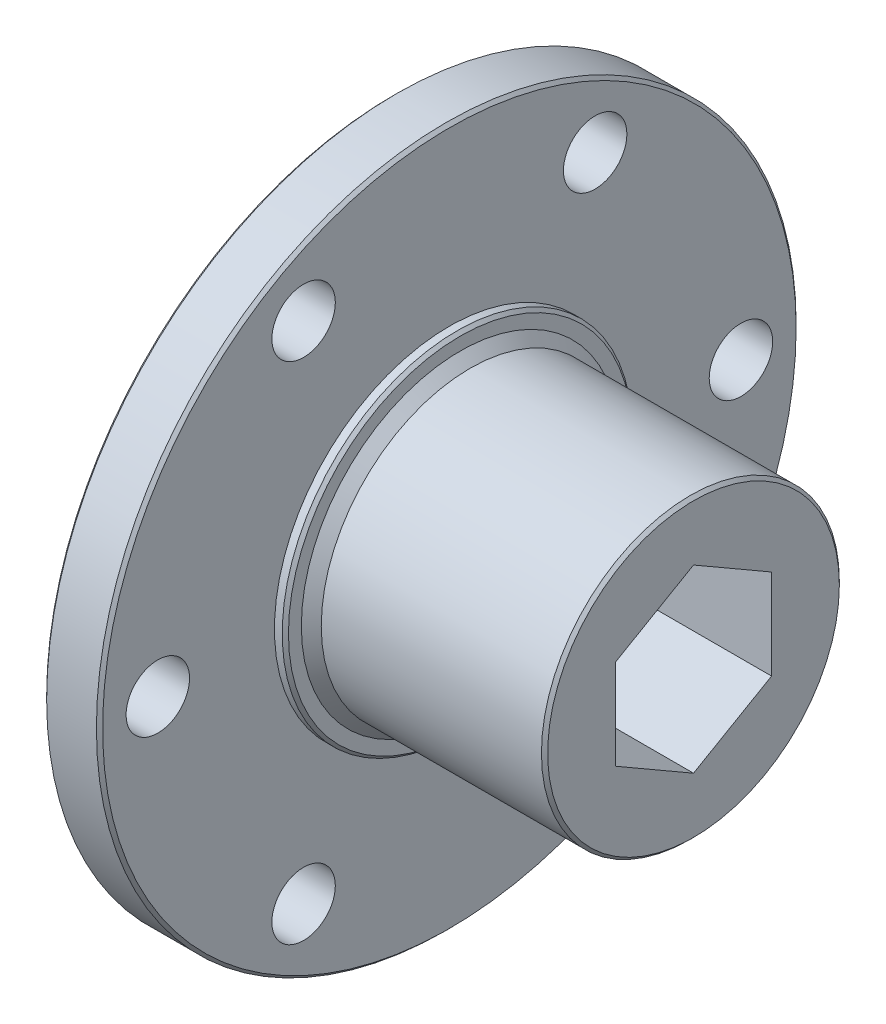
ISO-10303-21;
HEADER;
FILE_DESCRIPTION(('STEP AP214'),'2;1');
FILE_NAME('part.step','',(''),(''),'','','');
FILE_SCHEMA(('AUTOMOTIVE_DESIGN { 1 0 10303 214 1 1 1 1 }'));
ENDSEC;
DATA;
#1=APPLICATION_CONTEXT('core data for automotive mechanical design processes');
#2=APPLICATION_PROTOCOL_DEFINITION('international standard','automotive_design',2000,#1);
#3=PRODUCT_CONTEXT('',#1,'mechanical');
#4=PRODUCT('Part','Part','',(#3));
#5=PRODUCT_RELATED_PRODUCT_CATEGORY('part','',(#4));
#6=PRODUCT_DEFINITION_FORMATION('','',#4);
#7=PRODUCT_DEFINITION_CONTEXT('part definition',#1,'design');
#8=PRODUCT_DEFINITION('design','',#6,#7);
#9=PRODUCT_DEFINITION_SHAPE('','',#8);
#10=(LENGTH_UNIT() NAMED_UNIT(*) SI_UNIT(.MILLI.,.METRE.));
#11=(NAMED_UNIT(*) PLANE_ANGLE_UNIT() SI_UNIT($,.RADIAN.));
#12=(NAMED_UNIT(*) SI_UNIT($,.STERADIAN.) SOLID_ANGLE_UNIT());
#13=UNCERTAINTY_MEASURE_WITH_UNIT(LENGTH_MEASURE(1.E-05),#10,'distance_accuracy_value','');
#14=(GEOMETRIC_REPRESENTATION_CONTEXT(3) GLOBAL_UNCERTAINTY_ASSIGNED_CONTEXT((#13)) GLOBAL_UNIT_ASSIGNED_CONTEXT((#10,
#11,#12)) REPRESENTATION_CONTEXT('',''));
#15=CARTESIAN_POINT('',(0.,0.,0.));
#16=DIRECTION('',(0.,0.,1.));
#17=DIRECTION('',(1.,0.,0.));
#18=AXIS2_PLACEMENT_3D('',#15,#16,#17);
#19=CARTESIAN_POINT('',(-13.9240662460568,0.,0.));
#20=DIRECTION('',(-1.,0.,0.));
#21=DIRECTION('',(0.,0.,1.));
#22=AXIS2_PLACEMENT_3D('',#19,#20,#21);
#23=CYLINDRICAL_SURFACE('',#22,28.575);
#24=CARTESIAN_POINT('',(-18.2420662460566,0.,0.));
#25=DIRECTION('',(-1.,0.,0.));
#26=DIRECTION('',(0.,0.,1.));
#27=AXIS2_PLACEMENT_3D('',#24,#25,#26);
#28=CIRCLE('',#27,28.575);
#29=CARTESIAN_POINT('',(-18.2420662460566,0.,28.575));
#30=VERTEX_POINT('',#29);
#31=EDGE_CURVE('E174',#30,#30,#28,.F.);
#32=ORIENTED_EDGE('',*,*,#31,.T.);
#33=EDGE_LOOP('',(#32));
#34=FACE_BOUND('',#33,.T.);
#35=CARTESIAN_POINT('',(-14.1780662460569,0.,0.));
#36=DIRECTION('',(1.,0.,0.));
#37=DIRECTION('',(0.,0.,-1.));
#38=AXIS2_PLACEMENT_3D('',#35,#36,#37);
#39=CIRCLE('',#38,28.575);
#40=CARTESIAN_POINT('',(-14.1780662460569,0.,-28.575));
#41=VERTEX_POINT('',#40);
#42=EDGE_CURVE('E171',#41,#41,#39,.F.);
#43=ORIENTED_EDGE('',*,*,#42,.T.);
#44=EDGE_LOOP('',(#43));
#45=FACE_BOUND('',#44,.T.);
#46=ADVANCED_FACE('F32',(#34,#45),#23,.T.);
#47=CARTESIAN_POINT('',(-13.9240662460568,28.575,0.));
#48=DIRECTION('',(1.,0.,0.));
#49=DIRECTION('',(0.,0.,-1.));
#50=AXIS2_PLACEMENT_3D('',#47,#48,#49);
#51=PLANE('',#50);
#52=CARTESIAN_POINT('',(-13.9240662460568,0.,0.));
#53=DIRECTION('',(1.,0.,0.));
#54=DIRECTION('',(0.,0.,-1.));
#55=AXIS2_PLACEMENT_3D('',#52,#53,#54);
#56=CIRCLE('',#55,28.3209999999999);
#57=CARTESIAN_POINT('',(-13.9240662460568,0.,-28.3209999999999));
#58=VERTEX_POINT('',#57);
#59=EDGE_CURVE('E11',#58,#58,#56,.T.);
#60=ORIENTED_EDGE('',*,*,#59,.T.);
#61=EDGE_LOOP('',(#60));
#62=FACE_BOUND('',#61,.T.);
#63=CARTESIAN_POINT('',(-13.9240662460568,20.6222299276169,11.90625));
#64=DIRECTION('',(1.,0.,0.));
#65=DIRECTION('',(0.,0.,-1.));
#66=AXIS2_PLACEMENT_3D('',#63,#64,#65);
#67=CIRCLE('',#66,2.5908);
#68=CARTESIAN_POINT('',(-13.9240662460568,20.6222299276169,9.31545000000001));
#69=VERTEX_POINT('',#68);
#70=EDGE_CURVE('E152',#69,#69,#67,.T.);
#71=ORIENTED_EDGE('',*,*,#70,.F.);
#72=EDGE_LOOP('',(#71));
#73=FACE_BOUND('',#72,.T.);
#74=CARTESIAN_POINT('',(-13.9240662460568,0.,-23.8125));
#75=DIRECTION('',(1.,0.,0.));
#76=DIRECTION('',(0.,0.,-1.));
#77=AXIS2_PLACEMENT_3D('',#74,#75,#76);
#78=CIRCLE('',#77,2.5908);
#79=CARTESIAN_POINT('',(-13.9240662460568,0.,-26.4033));
#80=VERTEX_POINT('',#79);
#81=EDGE_CURVE('E326',#80,#80,#78,.T.);
#82=ORIENTED_EDGE('',*,*,#81,.F.);
#83=EDGE_LOOP('',(#82));
#84=FACE_BOUND('',#83,.T.);
#85=CARTESIAN_POINT('',(-13.9240662460568,-20.622229927617,11.9062499999999));
#86=DIRECTION('',(1.,0.,0.));
#87=DIRECTION('',(0.,0.,-1.));
#88=AXIS2_PLACEMENT_3D('',#85,#86,#87);
#89=CIRCLE('',#88,2.5908);
#90=CARTESIAN_POINT('',(-13.9240662460568,-20.622229927617,9.31544999999995));
#91=VERTEX_POINT('',#90);
#92=EDGE_CURVE('E330',#91,#91,#89,.T.);
#93=ORIENTED_EDGE('',*,*,#92,.F.);
#94=EDGE_LOOP('',(#93));
#95=FACE_BOUND('',#94,.T.);
#96=CARTESIAN_POINT('',(-13.9240662460568,-20.6222299276169,-11.90625));
#97=DIRECTION('',(1.,0.,0.));
#98=DIRECTION('',(0.,0.,-1.));
#99=AXIS2_PLACEMENT_3D('',#96,#97,#98);
#100=CIRCLE('',#99,2.5908);
#101=CARTESIAN_POINT('',(-13.9240662460568,-20.6222299276169,-14.49705));
#102=VERTEX_POINT('',#101);
#103=EDGE_CURVE('E334',#102,#102,#100,.T.);
#104=ORIENTED_EDGE('',*,*,#103,.F.);
#105=EDGE_LOOP('',(#104));
#106=FACE_BOUND('',#105,.T.);
#107=CARTESIAN_POINT('',(-13.9240662460568,20.622229927617,-11.90625));
#108=DIRECTION('',(1.,0.,0.));
#109=DIRECTION('',(0.,0.,-1.));
#110=AXIS2_PLACEMENT_3D('',#107,#108,#109);
#111=CIRCLE('',#110,2.5908);
#112=CARTESIAN_POINT('',(-13.9240662460568,20.622229927617,-14.49705));
#113=VERTEX_POINT('',#112);
#114=EDGE_CURVE('E338',#113,#113,#111,.T.);
#115=ORIENTED_EDGE('',*,*,#114,.F.);
#116=EDGE_LOOP('',(#115));
#117=FACE_BOUND('',#116,.T.);
#118=CARTESIAN_POINT('',(-13.9240662460568,0.,23.8125));
#119=DIRECTION('',(1.,0.,0.));
#120=DIRECTION('',(0.,0.,-1.));
#121=AXIS2_PLACEMENT_3D('',#118,#119,#120);
#122=CIRCLE('',#121,2.5908);
#123=CARTESIAN_POINT('',(-13.9240662460568,0.,21.2217));
#124=VERTEX_POINT('',#123);
#125=EDGE_CURVE('E109',#124,#124,#122,.T.);
#126=ORIENTED_EDGE('',*,*,#125,.F.);
#127=EDGE_LOOP('',(#126));
#128=FACE_BOUND('',#127,.T.);
#129=CARTESIAN_POINT('',(-13.9240662460568,0.,0.));
#130=DIRECTION('',(1.,0.,0.));
#131=DIRECTION('',(0.,0.,-1.));
#132=AXIS2_PLACEMENT_3D('',#129,#130,#131);
#133=CIRCLE('',#132,14.2875);
#134=CARTESIAN_POINT('',(-13.9240662460568,0.,-14.2875));
#135=VERTEX_POINT('',#134);
#136=EDGE_CURVE('E147',#135,#135,#133,.T.);
#137=ORIENTED_EDGE('',*,*,#136,.F.);
#138=EDGE_LOOP('',(#137));
#139=FACE_BOUND('',#138,.T.);
#140=ADVANCED_FACE('F209',(#62,#73,#84,#95,#106,#117,#128,#139),#51,.T.);
#141=CARTESIAN_POINT('',(-18.4960662460568,0.,0.));
#142=DIRECTION('',(-1.,0.,0.));
#143=DIRECTION('',(0.,0.,1.));
#144=AXIS2_PLACEMENT_3D('',#141,#142,#143);
#145=PLANE('',#144);
#146=CARTESIAN_POINT('',(-18.4960662460568,0.,0.));
#147=DIRECTION('',(-1.,0.,0.));
#148=DIRECTION('',(0.,0.,1.));
#149=AXIS2_PLACEMENT_3D('',#146,#147,#148);
#150=CIRCLE('',#149,28.3209999999999);
#151=CARTESIAN_POINT('',(-18.4960662460568,0.,28.3209999999999));
#152=VERTEX_POINT('',#151);
#153=EDGE_CURVE('E168',#152,#152,#150,.T.);
#154=ORIENTED_EDGE('',*,*,#153,.T.);
#155=EDGE_LOOP('',(#154));
#156=FACE_BOUND('',#155,.T.);
#157=CARTESIAN_POINT('',(-18.4960662460568,20.6222299276169,11.90625));
#158=DIRECTION('',(-1.,0.,0.));
#159=DIRECTION('',(0.,0.,1.));
#160=AXIS2_PLACEMENT_3D('',#157,#158,#159);
#161=CIRCLE('',#160,2.5908);
#162=CARTESIAN_POINT('',(-18.4960662460568,20.6222299276169,14.49705));
#163=VERTEX_POINT('',#162);
#164=EDGE_CURVE('E156',#163,#163,#161,.T.);
#165=ORIENTED_EDGE('',*,*,#164,.F.);
#166=EDGE_LOOP('',(#165));
#167=FACE_BOUND('',#166,.T.);
#168=CARTESIAN_POINT('',(-18.4960662460568,0.,-23.8125));
#169=DIRECTION('',(-1.,0.,0.));
#170=DIRECTION('',(0.,0.,1.));
#171=AXIS2_PLACEMENT_3D('',#168,#169,#170);
#172=CIRCLE('',#171,2.5908);
#173=CARTESIAN_POINT('',(-18.4960662460568,0.,-21.2217));
#174=VERTEX_POINT('',#173);
#175=EDGE_CURVE('E155',#174,#174,#172,.T.);
#176=ORIENTED_EDGE('',*,*,#175,.F.);
#177=EDGE_LOOP('',(#176));
#178=FACE_BOUND('',#177,.T.);
#179=CARTESIAN_POINT('',(-18.4960662460568,-20.622229927617,11.9062499999999));
#180=DIRECTION('',(-1.,0.,0.));
#181=DIRECTION('',(0.,0.,1.));
#182=AXIS2_PLACEMENT_3D('',#179,#180,#181);
#183=CIRCLE('',#182,2.5908);
#184=CARTESIAN_POINT('',(-18.4960662460568,-20.622229927617,14.4970499999999));
#185=VERTEX_POINT('',#184);
#186=EDGE_CURVE('E249',#185,#185,#183,.T.);
#187=ORIENTED_EDGE('',*,*,#186,.F.);
#188=EDGE_LOOP('',(#187));
#189=FACE_BOUND('',#188,.T.);
#190=CARTESIAN_POINT('',(-18.4960662460568,-20.6222299276169,-11.90625));
#191=DIRECTION('',(-1.,0.,0.));
#192=DIRECTION('',(0.,0.,1.));
#193=AXIS2_PLACEMENT_3D('',#190,#191,#192);
#194=CIRCLE('',#193,2.5908);
#195=CARTESIAN_POINT('',(-18.4960662460568,-20.6222299276169,-9.31545000000004));
#196=VERTEX_POINT('',#195);
#197=EDGE_CURVE('E253',#196,#196,#194,.T.);
#198=ORIENTED_EDGE('',*,*,#197,.F.);
#199=EDGE_LOOP('',(#198));
#200=FACE_BOUND('',#199,.T.);
#201=CARTESIAN_POINT('',(-18.4960662460568,20.622229927617,-11.90625));
#202=DIRECTION('',(-1.,0.,0.));
#203=DIRECTION('',(0.,0.,1.));
#204=AXIS2_PLACEMENT_3D('',#201,#202,#203);
#205=CIRCLE('',#204,2.5908);
#206=CARTESIAN_POINT('',(-18.4960662460568,20.622229927617,-9.31544999999997));
#207=VERTEX_POINT('',#206);
#208=EDGE_CURVE('E257',#207,#207,#205,.T.);
#209=ORIENTED_EDGE('',*,*,#208,.F.);
#210=EDGE_LOOP('',(#209));
#211=FACE_BOUND('',#210,.T.);
#212=CARTESIAN_POINT('',(-18.4960662460568,0.,23.8125));
#213=DIRECTION('',(-1.,0.,0.));
#214=DIRECTION('',(0.,0.,1.));
#215=AXIS2_PLACEMENT_3D('',#212,#213,#214);
#216=CIRCLE('',#215,2.5908);
#217=CARTESIAN_POINT('',(-18.4960662460568,0.,26.4033));
#218=VERTEX_POINT('',#217);
#219=EDGE_CURVE('E261',#218,#218,#216,.T.);
#220=ORIENTED_EDGE('',*,*,#219,.F.);
#221=EDGE_LOOP('',(#220));
#222=FACE_BOUND('',#221,.T.);
#223=CARTESIAN_POINT('',(-18.4960662460568,0.,0.));
#224=DIRECTION('',(-1.,0.,0.));
#225=DIRECTION('',(0.,0.,1.));
#226=AXIS2_PLACEMENT_3D('',#223,#224,#225);
#227=CIRCLE('',#226,14.2875);
#228=CARTESIAN_POINT('',(-18.4960662460568,0.,14.2875));
#229=VERTEX_POINT('',#228);
#230=EDGE_CURVE('E140',#229,#229,#227,.T.);
#231=ORIENTED_EDGE('',*,*,#230,.F.);
#232=EDGE_LOOP('',(#231));
#233=FACE_BOUND('',#232,.T.);
#234=ADVANCED_FACE('F215',(#156,#167,#178,#189,#200,#211,#222,#233),#145,.T.);
#235=CARTESIAN_POINT('',(-13.0350662460568,0.,0.));
#236=DIRECTION('',(-1.,0.,0.));
#237=DIRECTION('',(0.,0.,1.));
#238=AXIS2_PLACEMENT_3D('',#235,#236,#237);
#239=CYLINDRICAL_SURFACE('',#238,14.2875);
#240=CARTESIAN_POINT('',(-13.2890662460569,0.,0.));
#241=DIRECTION('',(1.,0.,0.));
#242=DIRECTION('',(0.,0.,-1.));
#243=AXIS2_PLACEMENT_3D('',#240,#241,#242);
#244=CIRCLE('',#243,14.2875);
#245=CARTESIAN_POINT('',(-13.2890662460569,0.,-14.2875));
#246=VERTEX_POINT('',#245);
#247=EDGE_CURVE('E40',#246,#246,#244,.F.);
#248=ORIENTED_EDGE('',*,*,#247,.T.);
#249=EDGE_LOOP('',(#248));
#250=FACE_BOUND('',#249,.T.);
#251=ORIENTED_EDGE('',*,*,#136,.T.);
#252=EDGE_LOOP('',(#251));
#253=FACE_BOUND('',#252,.T.);
#254=ADVANCED_FACE('F182',(#250,#253),#239,.T.);
#255=CARTESIAN_POINT('',(-13.0350662460568,0.,0.));
#256=DIRECTION('',(1.,0.,0.));
#257=DIRECTION('',(0.,0.,-1.));
#258=AXIS2_PLACEMENT_3D('',#255,#256,#257);
#259=PLANE('',#258);
#260=CARTESIAN_POINT('',(-13.0350662460568,0.,0.));
#261=DIRECTION('',(1.,0.,0.));
#262=DIRECTION('',(0.,0.,-1.));
#263=AXIS2_PLACEMENT_3D('',#260,#261,#262);
#264=CIRCLE('',#263,14.0334999999999);
#265=CARTESIAN_POINT('',(-13.0350662460568,0.,-14.0334999999999));
#266=VERTEX_POINT('',#265);
#267=EDGE_CURVE('E177',#266,#266,#264,.T.);
#268=ORIENTED_EDGE('',*,*,#267,.T.);
#269=EDGE_LOOP('',(#268));
#270=FACE_BOUND('',#269,.T.);
#271=CARTESIAN_POINT('',(-13.0350662460568,0.,0.));
#272=DIRECTION('',(1.,0.,0.));
#273=DIRECTION('',(0.,0.,-1.));
#274=AXIS2_PLACEMENT_3D('',#271,#272,#273);
#275=CIRCLE('',#274,12.9794);
#276=CARTESIAN_POINT('',(-13.0350662460568,0.,-12.9794));
#277=VERTEX_POINT('',#276);
#278=EDGE_CURVE('E144',#277,#277,#275,.T.);
#279=ORIENTED_EDGE('',*,*,#278,.F.);
#280=EDGE_LOOP('',(#279));
#281=FACE_BOUND('',#280,.T.);
#282=ADVANCED_FACE('F191',(#270,#281),#259,.T.);
#283=CARTESIAN_POINT('',(-13.0350662460568,0.,0.));
#284=DIRECTION('',(-1.,0.,0.));
#285=DIRECTION('',(0.,0.,-1.));
#286=AXIS2_PLACEMENT_3D('',#283,#284,#285);
#287=CONICAL_SURFACE('',#286,12.9794,0.785398163397434);
#288=CARTESIAN_POINT('',(-12.2222662460567,0.,0.));
#289=DIRECTION('',(1.,0.,0.));
#290=DIRECTION('',(0.,0.,-1.));
#291=AXIS2_PLACEMENT_3D('',#288,#289,#290);
#292=CIRCLE('',#291,12.1666);
#293=CARTESIAN_POINT('',(-12.2222662460567,0.,-12.1666));
#294=VERTEX_POINT('',#293);
#295=EDGE_CURVE('E132',#294,#294,#292,.T.);
#296=ORIENTED_EDGE('',*,*,#295,.F.);
#297=EDGE_LOOP('',(#296));
#298=FACE_BOUND('',#297,.T.);
#299=ORIENTED_EDGE('',*,*,#278,.T.);
#300=EDGE_LOOP('',(#299));
#301=FACE_BOUND('',#300,.T.);
#302=ADVANCED_FACE('F194',(#298,#301),#287,.T.);
#303=CARTESIAN_POINT('',(6.01493375394323,0.,0.));
#304=DIRECTION('',(-1.,0.,0.));
#305=DIRECTION('',(0.,0.,1.));
#306=AXIS2_PLACEMENT_3D('',#303,#304,#305);
#307=CYLINDRICAL_SURFACE('',#306,12.1666);
#308=CARTESIAN_POINT('',(5.76093375394317,0.,0.));
#309=DIRECTION('',(1.,0.,0.));
#310=DIRECTION('',(0.,0.,-1.));
#311=AXIS2_PLACEMENT_3D('',#308,#309,#310);
#312=CIRCLE('',#311,12.1666);
#313=CARTESIAN_POINT('',(5.76093375394317,0.,-12.1666));
#314=VERTEX_POINT('',#313);
#315=EDGE_CURVE('E165',#314,#314,#312,.F.);
#316=ORIENTED_EDGE('',*,*,#315,.T.);
#317=EDGE_LOOP('',(#316));
#318=FACE_BOUND('',#317,.T.);
#319=ORIENTED_EDGE('',*,*,#295,.T.);
#320=EDGE_LOOP('',(#319));
#321=FACE_BOUND('',#320,.T.);
#322=ADVANCED_FACE('F199',(#318,#321),#307,.T.);
#323=CARTESIAN_POINT('',(6.01493375394323,0.,0.));
#324=DIRECTION('',(1.,0.,0.));
#325=DIRECTION('',(0.,0.,-1.));
#326=AXIS2_PLACEMENT_3D('',#323,#324,#325);
#327=PLANE('',#326);
#328=CARTESIAN_POINT('',(6.01493375394323,0.,0.));
#329=DIRECTION('',(1.,0.,0.));
#330=DIRECTION('',(0.,0.,-1.));
#331=AXIS2_PLACEMENT_3D('',#328,#329,#330);
#332=CIRCLE('',#331,11.9125999999999);
#333=CARTESIAN_POINT('',(6.01493375394323,0.,-11.9125999999999));
#334=VERTEX_POINT('',#333);
#335=EDGE_CURVE('E162',#334,#334,#332,.T.);
#336=ORIENTED_EDGE('',*,*,#335,.T.);
#337=EDGE_LOOP('',(#336));
#338=FACE_BOUND('',#337,.T.);
#339=DIRECTION('',(0.,0.500000000000001,-0.866025403784438));
#340=VECTOR('',#339,1.);
#341=CARTESIAN_POINT('',(6.01493375394323,3.68081890619155,6.3754));
#342=LINE('',#341,#340);
#343=CARTESIAN_POINT('',(6.01493375394323,3.68081890619155,6.3754));
#344=VERTEX_POINT('',#343);
#345=CARTESIAN_POINT('',(6.01493375394323,7.3616578123831,0.));
#346=VERTEX_POINT('',#345);
#347=EDGE_CURVE('E87',#344,#346,#342,.T.);
#348=ORIENTED_EDGE('',*,*,#347,.T.);
#349=DIRECTION('',(0.,-0.500000000000001,-0.866025403784438));
#350=VECTOR('',#349,1.);
#351=CARTESIAN_POINT('',(6.01493375394323,7.3616578123831,0.));
#352=LINE('',#351,#350);
#353=CARTESIAN_POINT('',(6.01493375394323,3.68081890619154,-6.37539999999999));
#354=VERTEX_POINT('',#353);
#355=EDGE_CURVE('E96',#346,#354,#352,.T.);
#356=ORIENTED_EDGE('',*,*,#355,.T.);
#357=DIRECTION('',(0.,-1.,0.));
#358=VECTOR('',#357,1.);
#359=CARTESIAN_POINT('',(6.01493375394323,3.68081890619155,-6.37539999999999));
#360=LINE('',#359,#358);
#361=CARTESIAN_POINT('',(6.01493375394323,-3.68085890619153,-6.37539999999999));
#362=VERTEX_POINT('',#361);
#363=EDGE_CURVE('E47',#354,#362,#360,.T.);
#364=ORIENTED_EDGE('',*,*,#363,.T.);
#365=DIRECTION('',(0.,-0.500000000000001,0.866025403784438));
#366=VECTOR('',#365,1.);
#367=CARTESIAN_POINT('',(6.01493375394323,-3.68085890619153,-6.37539999999999));
#368=LINE('',#367,#366);
#369=CARTESIAN_POINT('',(6.01493375394323,-7.36169781238308,0.));
#370=VERTEX_POINT('',#369);
#371=EDGE_CURVE('E113',#362,#370,#368,.T.);
#372=ORIENTED_EDGE('',*,*,#371,.T.);
#373=DIRECTION('',(0.,0.500000000000001,0.866025403784438));
#374=VECTOR('',#373,1.);
#375=CARTESIAN_POINT('',(6.01493375394323,-7.36169781238308,0.));
#376=LINE('',#375,#374);
#377=CARTESIAN_POINT('',(6.01493375394323,-3.68085890619153,6.3754));
#378=VERTEX_POINT('',#377);
#379=EDGE_CURVE('E116',#370,#378,#376,.T.);
#380=ORIENTED_EDGE('',*,*,#379,.T.);
#381=DIRECTION('',(0.,1.,0.));
#382=VECTOR('',#381,1.);
#383=CARTESIAN_POINT('',(6.01493375394323,-3.68085890619153,6.3754));
#384=LINE('',#383,#382);
#385=EDGE_CURVE('E93',#378,#344,#384,.T.);
#386=ORIENTED_EDGE('',*,*,#385,.T.);
#387=EDGE_LOOP('',(#348,#356,#364,#372,#380,#386));
#388=FACE_BOUND('',#387,.T.);
#389=ADVANCED_FACE('F100',(#338,#388),#327,.T.);
#390=CARTESIAN_POINT('',(-19.3850662460568,0.,0.));
#391=DIRECTION('',(1.,0.,0.));
#392=DIRECTION('',(0.,0.,-1.));
#393=AXIS2_PLACEMENT_3D('',#390,#391,#392);
#394=CYLINDRICAL_SURFACE('',#393,14.2875);
#395=CARTESIAN_POINT('',(-19.1310662460567,0.,0.));
#396=DIRECTION('',(-1.,0.,0.));
#397=DIRECTION('',(0.,0.,1.));
#398=AXIS2_PLACEMENT_3D('',#395,#396,#397);
#399=CIRCLE('',#398,14.2875);
#400=CARTESIAN_POINT('',(-19.1310662460567,0.,14.2875));
#401=VERTEX_POINT('',#400);
#402=EDGE_CURVE('E159',#401,#401,#399,.F.);
#403=ORIENTED_EDGE('',*,*,#402,.T.);
#404=EDGE_LOOP('',(#403));
#405=FACE_BOUND('',#404,.T.);
#406=ORIENTED_EDGE('',*,*,#230,.T.);
#407=EDGE_LOOP('',(#406));
#408=FACE_BOUND('',#407,.T.);
#409=ADVANCED_FACE('F264',(#405,#408),#394,.T.);
#410=CARTESIAN_POINT('',(-19.3850662460568,0.,0.));
#411=DIRECTION('',(-1.,0.,0.));
#412=DIRECTION('',(0.,0.,1.));
#413=AXIS2_PLACEMENT_3D('',#410,#411,#412);
#414=PLANE('',#413);
#415=CARTESIAN_POINT('',(-19.3850662460568,0.,0.));
#416=DIRECTION('',(-1.,0.,0.));
#417=DIRECTION('',(0.,0.,1.));
#418=AXIS2_PLACEMENT_3D('',#415,#416,#417);
#419=CIRCLE('',#418,14.0334999999999);
#420=CARTESIAN_POINT('',(-19.3850662460568,0.,14.0334999999999));
#421=VERTEX_POINT('',#420);
#422=EDGE_CURVE('E143',#421,#421,#419,.T.);
#423=ORIENTED_EDGE('',*,*,#422,.T.);
#424=EDGE_LOOP('',(#423));
#425=FACE_BOUND('',#424,.T.);
#426=DIRECTION('',(0.,0.500000000000001,-0.866025403784438));
#427=VECTOR('',#426,1.);
#428=CARTESIAN_POINT('',(-19.3850662460568,3.68081890619155,6.3754));
#429=LINE('',#428,#427);
#430=CARTESIAN_POINT('',(-19.3850662460568,3.68081890619155,6.3754));
#431=VERTEX_POINT('',#430);
#432=CARTESIAN_POINT('',(-19.3850662460568,7.36165781238309,0.));
#433=VERTEX_POINT('',#432);
#434=EDGE_CURVE('E55',#431,#433,#429,.T.);
#435=ORIENTED_EDGE('',*,*,#434,.F.);
#436=DIRECTION('',(0.,1.,0.));
#437=VECTOR('',#436,1.);
#438=CARTESIAN_POINT('',(-19.3850662460568,-3.68085890619153,6.3754));
#439=LINE('',#438,#437);
#440=CARTESIAN_POINT('',(-19.3850662460568,-3.68085890619153,6.3754));
#441=VERTEX_POINT('',#440);
#442=EDGE_CURVE('E103',#441,#431,#439,.T.);
#443=ORIENTED_EDGE('',*,*,#442,.F.);
#444=DIRECTION('',(0.,0.500000000000001,0.866025403784438));
#445=VECTOR('',#444,1.);
#446=CARTESIAN_POINT('',(-19.3850662460568,-7.36169781238308,0.));
#447=LINE('',#446,#445);
#448=CARTESIAN_POINT('',(-19.3850662460568,-7.36169781238308,0.));
#449=VERTEX_POINT('',#448);
#450=EDGE_CURVE('E106',#449,#441,#447,.T.);
#451=ORIENTED_EDGE('',*,*,#450,.F.);
#452=DIRECTION('',(0.,-0.500000000000001,0.866025403784438));
#453=VECTOR('',#452,1.);
#454=CARTESIAN_POINT('',(-19.3850662460568,-3.68085890619153,-6.37539999999999));
#455=LINE('',#454,#453);
#456=CARTESIAN_POINT('',(-19.3850662460568,-3.68085890619153,-6.37539999999999));
#457=VERTEX_POINT('',#456);
#458=EDGE_CURVE('E125',#457,#449,#455,.T.);
#459=ORIENTED_EDGE('',*,*,#458,.F.);
#460=DIRECTION('',(0.,-1.,0.));
#461=VECTOR('',#460,1.);
#462=CARTESIAN_POINT('',(-19.3850662460568,3.68081890619155,-6.37539999999999));
#463=LINE('',#462,#461);
#464=CARTESIAN_POINT('',(-19.3850662460568,3.68081890619155,-6.37539999999999));
#465=VERTEX_POINT('',#464);
#466=EDGE_CURVE('E122',#465,#457,#463,.T.);
#467=ORIENTED_EDGE('',*,*,#466,.F.);
#468=DIRECTION('',(0.,-0.500000000000001,-0.866025403784438));
#469=VECTOR('',#468,1.);
#470=CARTESIAN_POINT('',(-19.3850662460568,7.3616578123831,0.));
#471=LINE('',#470,#469);
#472=EDGE_CURVE('E120',#433,#465,#471,.T.);
#473=ORIENTED_EDGE('',*,*,#472,.F.);
#474=EDGE_LOOP('',(#435,#443,#451,#459,#467,#473));
#475=FACE_BOUND('',#474,.T.);
#476=ADVANCED_FACE('F266',(#425,#475),#414,.T.);
#477=CARTESIAN_POINT('',(6.01493375394323,3.68081890619155,6.3754));
#478=DIRECTION('',(0.,0.866025403784438,0.500000000000001));
#479=DIRECTION('',(0.,-0.500000000000001,0.866025403784438));
#480=AXIS2_PLACEMENT_3D('',#477,#478,#479);
#481=PLANE('',#480);
#482=ORIENTED_EDGE('',*,*,#434,.T.);
#483=DIRECTION('',(-1.,0.,0.));
#484=VECTOR('',#483,1.);
#485=CARTESIAN_POINT('',(6.01493375394323,7.3616578123831,0.));
#486=LINE('',#485,#484);
#487=EDGE_CURVE('E83',#346,#433,#486,.T.);
#488=ORIENTED_EDGE('',*,*,#487,.F.);
#489=ORIENTED_EDGE('',*,*,#347,.F.);
#490=DIRECTION('',(-1.,0.,0.));
#491=VECTOR('',#490,1.);
#492=CARTESIAN_POINT('',(6.01493375394323,3.68081890619155,6.3754));
#493=LINE('',#492,#491);
#494=EDGE_CURVE('E130',#344,#431,#493,.T.);
#495=ORIENTED_EDGE('',*,*,#494,.T.);
#496=EDGE_LOOP('',(#482,#488,#489,#495));
#497=FACE_BOUND('',#496,.T.);
#498=ADVANCED_FACE('F85',(#497),#481,.F.);
#499=CARTESIAN_POINT('',(6.01493375394323,-3.68085890619153,6.3754));
#500=DIRECTION('',(0.,0.,1.));
#501=DIRECTION('',(0.,-1.,0.));
#502=AXIS2_PLACEMENT_3D('',#499,#500,#501);
#503=PLANE('',#502);
#504=ORIENTED_EDGE('',*,*,#442,.T.);
#505=ORIENTED_EDGE('',*,*,#494,.F.);
#506=ORIENTED_EDGE('',*,*,#385,.F.);
#507=DIRECTION('',(-1.,0.,0.));
#508=VECTOR('',#507,1.);
#509=CARTESIAN_POINT('',(6.01493375394323,-3.68085890619153,6.3754));
#510=LINE('',#509,#508);
#511=EDGE_CURVE('E133',#378,#441,#510,.T.);
#512=ORIENTED_EDGE('',*,*,#511,.T.);
#513=EDGE_LOOP('',(#504,#505,#506,#512));
#514=FACE_BOUND('',#513,.T.);
#515=ADVANCED_FACE('F280',(#514),#503,.F.);
#516=CARTESIAN_POINT('',(6.01493375394323,-7.36169781238308,0.));
#517=DIRECTION('',(0.,-0.866025403784438,0.500000000000001));
#518=DIRECTION('',(0.,-0.500000000000001,-0.866025403784438));
#519=AXIS2_PLACEMENT_3D('',#516,#517,#518);
#520=PLANE('',#519);
#521=ORIENTED_EDGE('',*,*,#450,.T.);
#522=ORIENTED_EDGE('',*,*,#511,.F.);
#523=ORIENTED_EDGE('',*,*,#379,.F.);
#524=DIRECTION('',(-1.,0.,0.));
#525=VECTOR('',#524,1.);
#526=CARTESIAN_POINT('',(6.01493375394323,-7.36169781238308,0.));
#527=LINE('',#526,#525);
#528=EDGE_CURVE('E135',#370,#449,#527,.T.);
#529=ORIENTED_EDGE('',*,*,#528,.T.);
#530=EDGE_LOOP('',(#521,#522,#523,#529));
#531=FACE_BOUND('',#530,.T.);
#532=ADVANCED_FACE('F290',(#531),#520,.F.);
#533=CARTESIAN_POINT('',(6.01493375394323,-3.68085890619153,-6.37539999999999));
#534=DIRECTION('',(0.,-0.866025403784438,-0.500000000000001));
#535=DIRECTION('',(0.,0.500000000000001,-0.866025403784438));
#536=AXIS2_PLACEMENT_3D('',#533,#534,#535);
#537=PLANE('',#536);
#538=ORIENTED_EDGE('',*,*,#458,.T.);
#539=ORIENTED_EDGE('',*,*,#528,.F.);
#540=ORIENTED_EDGE('',*,*,#371,.F.);
#541=DIRECTION('',(-1.,0.,0.));
#542=VECTOR('',#541,1.);
#543=CARTESIAN_POINT('',(6.01493375394323,-3.68085890619153,-6.37539999999999));
#544=LINE('',#543,#542);
#545=EDGE_CURVE('E137',#362,#457,#544,.T.);
#546=ORIENTED_EDGE('',*,*,#545,.T.);
#547=EDGE_LOOP('',(#538,#539,#540,#546));
#548=FACE_BOUND('',#547,.T.);
#549=ADVANCED_FACE('F287',(#548),#537,.F.);
#550=CARTESIAN_POINT('',(6.01493375394323,3.68081890619155,-6.37539999999999));
#551=DIRECTION('',(0.,0.,-1.));
#552=DIRECTION('',(0.,1.,0.));
#553=AXIS2_PLACEMENT_3D('',#550,#551,#552);
#554=PLANE('',#553);
#555=ORIENTED_EDGE('',*,*,#466,.T.);
#556=ORIENTED_EDGE('',*,*,#545,.F.);
#557=ORIENTED_EDGE('',*,*,#363,.F.);
#558=DIRECTION('',(-1.,0.,0.));
#559=VECTOR('',#558,1.);
#560=CARTESIAN_POINT('',(6.01493375394323,3.68081890619155,-6.37539999999999));
#561=LINE('',#560,#559);
#562=EDGE_CURVE('E92',#354,#465,#561,.T.);
#563=ORIENTED_EDGE('',*,*,#562,.T.);
#564=EDGE_LOOP('',(#555,#556,#557,#563));
#565=FACE_BOUND('',#564,.T.);
#566=ADVANCED_FACE('F284',(#565),#554,.F.);
#567=CARTESIAN_POINT('',(6.01493375394323,7.3616578123831,0.));
#568=DIRECTION('',(0.,0.866025403784438,-0.500000000000001));
#569=DIRECTION('',(0.,0.500000000000001,0.866025403784438));
#570=AXIS2_PLACEMENT_3D('',#567,#568,#569);
#571=PLANE('',#570);
#572=ORIENTED_EDGE('',*,*,#472,.T.);
#573=ORIENTED_EDGE('',*,*,#562,.F.);
#574=ORIENTED_EDGE('',*,*,#355,.F.);
#575=ORIENTED_EDGE('',*,*,#487,.T.);
#576=EDGE_LOOP('',(#572,#573,#574,#575));
#577=FACE_BOUND('',#576,.T.);
#578=ADVANCED_FACE('F97',(#577),#571,.F.);
#579=CARTESIAN_POINT('',(-18.4960662460568,0.,23.8125));
#580=DIRECTION('',(-1.,0.,0.));
#581=DIRECTION('',(0.,0.,1.));
#582=AXIS2_PLACEMENT_3D('',#579,#580,#581);
#583=CYLINDRICAL_SURFACE('',#582,2.5908);
#584=ORIENTED_EDGE('',*,*,#125,.T.);
#585=EDGE_LOOP('',(#584));
#586=FACE_BOUND('',#585,.T.);
#587=ORIENTED_EDGE('',*,*,#219,.T.);
#588=EDGE_LOOP('',(#587));
#589=FACE_BOUND('',#588,.T.);
#590=ADVANCED_FACE('F283',(#586,#589),#583,.F.);
#591=CARTESIAN_POINT('',(-18.4960662460568,20.622229927617,-11.90625));
#592=DIRECTION('',(-1.,0.,0.));
#593=DIRECTION('',(0.,0.,1.));
#594=AXIS2_PLACEMENT_3D('',#591,#592,#593);
#595=CYLINDRICAL_SURFACE('',#594,2.5908);
#596=ORIENTED_EDGE('',*,*,#114,.T.);
#597=EDGE_LOOP('',(#596));
#598=FACE_BOUND('',#597,.T.);
#599=ORIENTED_EDGE('',*,*,#208,.T.);
#600=EDGE_LOOP('',(#599));
#601=FACE_BOUND('',#600,.T.);
#602=ADVANCED_FACE('F300',(#598,#601),#595,.F.);
#603=CARTESIAN_POINT('',(-18.4960662460568,-20.6222299276169,-11.90625));
#604=DIRECTION('',(-1.,0.,0.));
#605=DIRECTION('',(0.,0.,1.));
#606=AXIS2_PLACEMENT_3D('',#603,#604,#605);
#607=CYLINDRICAL_SURFACE('',#606,2.5908);
#608=ORIENTED_EDGE('',*,*,#103,.T.);
#609=EDGE_LOOP('',(#608));
#610=FACE_BOUND('',#609,.T.);
#611=ORIENTED_EDGE('',*,*,#197,.T.);
#612=EDGE_LOOP('',(#611));
#613=FACE_BOUND('',#612,.T.);
#614=ADVANCED_FACE('F304',(#610,#613),#607,.F.);
#615=CARTESIAN_POINT('',(-18.4960662460568,-20.622229927617,11.9062499999999));
#616=DIRECTION('',(-1.,0.,0.));
#617=DIRECTION('',(0.,0.,1.));
#618=AXIS2_PLACEMENT_3D('',#615,#616,#617);
#619=CYLINDRICAL_SURFACE('',#618,2.5908);
#620=ORIENTED_EDGE('',*,*,#92,.T.);
#621=EDGE_LOOP('',(#620));
#622=FACE_BOUND('',#621,.T.);
#623=ORIENTED_EDGE('',*,*,#186,.T.);
#624=EDGE_LOOP('',(#623));
#625=FACE_BOUND('',#624,.T.);
#626=ADVANCED_FACE('F308',(#622,#625),#619,.F.);
#627=CARTESIAN_POINT('',(-18.4960662460568,0.,-23.8125));
#628=DIRECTION('',(-1.,0.,0.));
#629=DIRECTION('',(0.,0.,1.));
#630=AXIS2_PLACEMENT_3D('',#627,#628,#629);
#631=CYLINDRICAL_SURFACE('',#630,2.5908);
#632=ORIENTED_EDGE('',*,*,#81,.T.);
#633=EDGE_LOOP('',(#632));
#634=FACE_BOUND('',#633,.T.);
#635=ORIENTED_EDGE('',*,*,#175,.T.);
#636=EDGE_LOOP('',(#635));
#637=FACE_BOUND('',#636,.T.);
#638=ADVANCED_FACE('F312',(#634,#637),#631,.F.);
#639=CARTESIAN_POINT('',(-18.4960662460568,20.6222299276169,11.90625));
#640=DIRECTION('',(-1.,0.,0.));
#641=DIRECTION('',(0.,0.,1.));
#642=AXIS2_PLACEMENT_3D('',#639,#640,#641);
#643=CYLINDRICAL_SURFACE('',#642,2.5908);
#644=ORIENTED_EDGE('',*,*,#70,.T.);
#645=EDGE_LOOP('',(#644));
#646=FACE_BOUND('',#645,.T.);
#647=ORIENTED_EDGE('',*,*,#164,.T.);
#648=EDGE_LOOP('',(#647));
#649=FACE_BOUND('',#648,.T.);
#650=ADVANCED_FACE('F225',(#646,#649),#643,.F.);
#651=CARTESIAN_POINT('',(-19.3850662460568,0.,0.));
#652=DIRECTION('',(1.,0.,0.));
#653=DIRECTION('',(0.,0.,-1.));
#654=AXIS2_PLACEMENT_3D('',#651,#652,#653);
#655=CONICAL_SURFACE('',#654,14.0334999999999,0.785398163397448);
#656=ORIENTED_EDGE('',*,*,#402,.F.);
#657=EDGE_LOOP('',(#656));
#658=FACE_BOUND('',#657,.T.);
#659=ORIENTED_EDGE('',*,*,#422,.F.);
#660=EDGE_LOOP('',(#659));
#661=FACE_BOUND('',#660,.T.);
#662=ADVANCED_FACE('F221',(#658,#661),#655,.T.);
#663=CARTESIAN_POINT('',(6.01493375394323,0.,0.));
#664=DIRECTION('',(-1.,0.,0.));
#665=DIRECTION('',(0.,0.,1.));
#666=AXIS2_PLACEMENT_3D('',#663,#664,#665);
#667=CONICAL_SURFACE('',#666,11.9125999999999,0.785398163397452);
#668=ORIENTED_EDGE('',*,*,#315,.F.);
#669=EDGE_LOOP('',(#668));
#670=FACE_BOUND('',#669,.T.);
#671=ORIENTED_EDGE('',*,*,#335,.F.);
#672=EDGE_LOOP('',(#671));
#673=FACE_BOUND('',#672,.T.);
#674=ADVANCED_FACE('F224',(#670,#673),#667,.T.);
#675=CARTESIAN_POINT('',(-18.4960662460568,0.,0.));
#676=DIRECTION('',(1.,0.,0.));
#677=DIRECTION('',(0.,0.,-1.));
#678=AXIS2_PLACEMENT_3D('',#675,#676,#677);
#679=CONICAL_SURFACE('',#678,28.3209999999999,0.785398163397455);
#680=ORIENTED_EDGE('',*,*,#31,.F.);
#681=EDGE_LOOP('',(#680));
#682=FACE_BOUND('',#681,.T.);
#683=ORIENTED_EDGE('',*,*,#153,.F.);
#684=EDGE_LOOP('',(#683));
#685=FACE_BOUND('',#684,.T.);
#686=ADVANCED_FACE('F188',(#682,#685),#679,.T.);
#687=CARTESIAN_POINT('',(-13.0350662460568,0.,0.));
#688=DIRECTION('',(-1.,0.,0.));
#689=DIRECTION('',(0.,0.,1.));
#690=AXIS2_PLACEMENT_3D('',#687,#688,#689);
#691=CONICAL_SURFACE('',#690,14.0334999999999,0.785398163397445);
#692=ORIENTED_EDGE('',*,*,#247,.F.);
#693=EDGE_LOOP('',(#692));
#694=FACE_BOUND('',#693,.T.);
#695=ORIENTED_EDGE('',*,*,#267,.F.);
#696=EDGE_LOOP('',(#695));
#697=FACE_BOUND('',#696,.T.);
#698=ADVANCED_FACE('F185',(#694,#697),#691,.T.);
#699=CARTESIAN_POINT('',(-14.1780662460569,0.,0.));
#700=DIRECTION('',(-1.,0.,0.));
#701=DIRECTION('',(0.,0.,1.));
#702=AXIS2_PLACEMENT_3D('',#699,#700,#701);
#703=CONICAL_SURFACE('',#702,28.575,0.785398163397455);
#704=ORIENTED_EDGE('',*,*,#59,.F.);
#705=EDGE_LOOP('',(#704));
#706=FACE_BOUND('',#705,.T.);
#707=ORIENTED_EDGE('',*,*,#42,.F.);
#708=EDGE_LOOP('',(#707));
#709=FACE_BOUND('',#708,.T.);
#710=ADVANCED_FACE('F34',(#706,#709),#703,.T.);
#711=CLOSED_SHELL('',(#46,#140,#234,#254,#282,#302,#322,#389,#409,#476,#498,#515,#532,#549,#566,
#578,#590,#602,#614,#626,#638,#650,#662,#674,#686,#698,#710));
#712=MANIFOLD_SOLID_BREP('B2',#711);
#713=ADVANCED_BREP_SHAPE_REPRESENTATION('',(#18,#712),#14);
#714=SHAPE_DEFINITION_REPRESENTATION(#9,#713);
ENDSEC;
END-ISO-10303-21;
